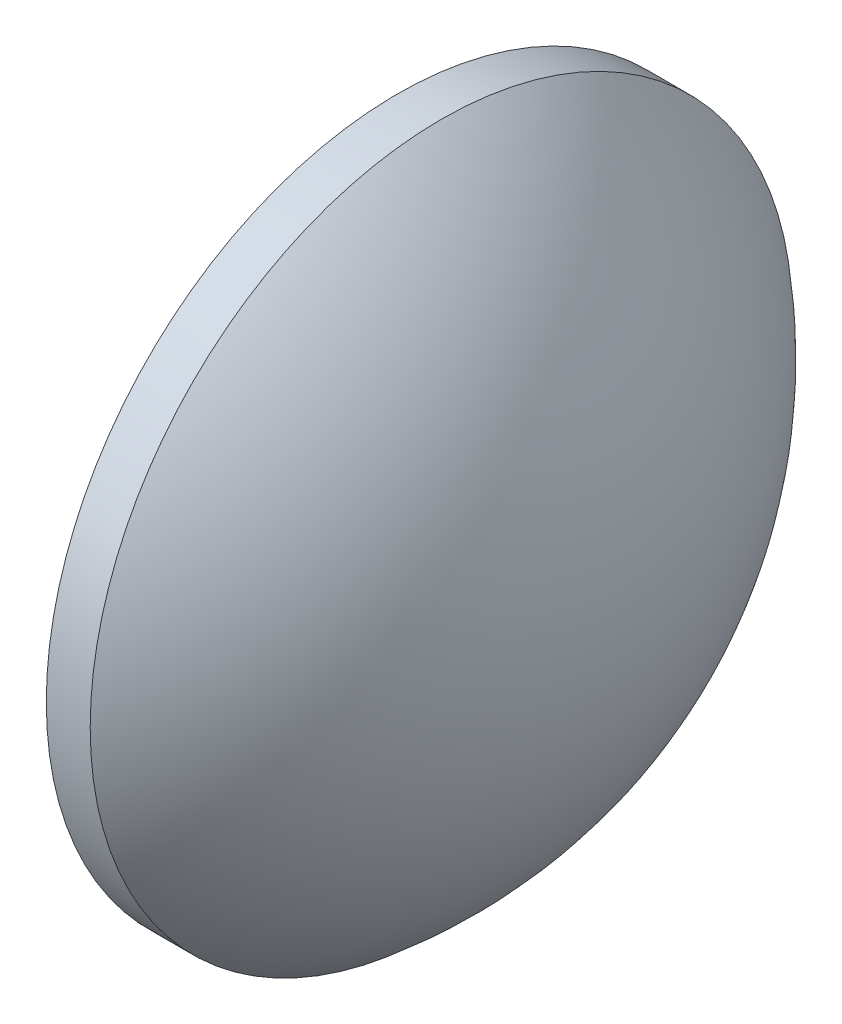
ISO-10303-21;
HEADER;
FILE_DESCRIPTION(('STEP AP214'),'2;1');
FILE_NAME('part.step','',(''),(''),'','','');
FILE_SCHEMA(('AUTOMOTIVE_DESIGN { 1 0 10303 214 1 1 1 1 }'));
ENDSEC;
DATA;
#1=APPLICATION_CONTEXT('core data for automotive mechanical design processes');
#2=APPLICATION_PROTOCOL_DEFINITION('international standard','automotive_design',2000,#1);
#3=PRODUCT_CONTEXT('',#1,'mechanical');
#4=PRODUCT('Part','Part','',(#3));
#5=PRODUCT_RELATED_PRODUCT_CATEGORY('part','',(#4));
#6=PRODUCT_DEFINITION_FORMATION('','',#4);
#7=PRODUCT_DEFINITION_CONTEXT('part definition',#1,'design');
#8=PRODUCT_DEFINITION('design','',#6,#7);
#9=PRODUCT_DEFINITION_SHAPE('','',#8);
#10=(LENGTH_UNIT() NAMED_UNIT(*) SI_UNIT(.MILLI.,.METRE.));
#11=(NAMED_UNIT(*) PLANE_ANGLE_UNIT() SI_UNIT($,.RADIAN.));
#12=(NAMED_UNIT(*) SI_UNIT($,.STERADIAN.) SOLID_ANGLE_UNIT());
#13=UNCERTAINTY_MEASURE_WITH_UNIT(LENGTH_MEASURE(1.E-05),#10,'distance_accuracy_value','');
#14=(GEOMETRIC_REPRESENTATION_CONTEXT(3) GLOBAL_UNCERTAINTY_ASSIGNED_CONTEXT((#13)) GLOBAL_UNIT_ASSIGNED_CONTEXT((#10,
#11,#12)) REPRESENTATION_CONTEXT('',''));
#15=CARTESIAN_POINT('',(0.,0.,0.));
#16=DIRECTION('',(0.,0.,1.));
#17=DIRECTION('',(1.,0.,0.));
#18=AXIS2_PLACEMENT_3D('',#15,#16,#17);
#19=CARTESIAN_POINT('',(99.5030710975186,65.0209453799623,0.));
#20=DIRECTION('',(-1.,0.,0.));
#21=DIRECTION('',(0.,1.,0.));
#22=AXIS2_PLACEMENT_3D('',#19,#20,#21);
#23=SPHERICAL_SURFACE('',#22,25.8370464135021);
#24=CARTESIAN_POINT('',(115.860117511021,65.0209453799623,0.));
#25=DIRECTION('',(-1.,0.,0.));
#26=DIRECTION('',(0.,0.,1.));
#27=AXIS2_PLACEMENT_3D('',#24,#25,#26);
#28=CIRCLE('',#27,20.);
#29=CARTESIAN_POINT('',(115.860117511021,65.0209453799623,20.));
#30=VERTEX_POINT('',#29);
#31=EDGE_CURVE('E10',#30,#30,#28,.T.);
#32=ORIENTED_EDGE('',*,*,#31,.F.);
#33=EDGE_LOOP('',(#32));
#34=FACE_BOUND('',#33,.T.);
#35=ADVANCED_FACE('F33',(#34),#23,.T.);
#36=CARTESIAN_POINT('',(108.665574330444,65.0209453799623,0.));
#37=DIRECTION('',(-1.,0.,0.));
#38=DIRECTION('',(0.,0.,1.));
#39=AXIS2_PLACEMENT_3D('',#36,#37,#38);
#40=CYLINDRICAL_SURFACE('',#39,20.);
#41=CARTESIAN_POINT('',(113.360117511021,65.0209453799623,0.));
#42=DIRECTION('',(-1.,0.,0.));
#43=DIRECTION('',(0.,0.,1.));
#44=AXIS2_PLACEMENT_3D('',#41,#42,#43);
#45=CIRCLE('',#44,20.);
#46=CARTESIAN_POINT('',(113.360117511021,65.0209453799623,20.));
#47=VERTEX_POINT('',#46);
#48=EDGE_CURVE('E39',#47,#47,#45,.T.);
#49=ORIENTED_EDGE('',*,*,#48,.F.);
#50=EDGE_LOOP('',(#49));
#51=FACE_BOUND('',#50,.T.);
#52=ORIENTED_EDGE('',*,*,#31,.T.);
#53=EDGE_LOOP('',(#52));
#54=FACE_BOUND('',#53,.T.);
#55=ADVANCED_FACE('F47',(#51,#54),#40,.T.);
#56=CARTESIAN_POINT('',(113.360117511021,65.0209453799623,0.));
#57=DIRECTION('',(1.,0.,0.));
#58=DIRECTION('',(0.,0.,-1.));
#59=AXIS2_PLACEMENT_3D('',#56,#57,#58);
#60=PLANE('',#59);
#61=ORIENTED_EDGE('',*,*,#48,.T.);
#62=EDGE_LOOP('',(#61));
#63=FACE_BOUND('',#62,.T.);
#64=ADVANCED_FACE('F45',(#63),#60,.F.);
#65=CLOSED_SHELL('',(#35,#55,#64));
#66=MANIFOLD_SOLID_BREP('B2',#65);
#67=ADVANCED_BREP_SHAPE_REPRESENTATION('',(#18,#66),#14);
#68=SHAPE_DEFINITION_REPRESENTATION(#9,#67);
ENDSEC;
END-ISO-10303-21;
